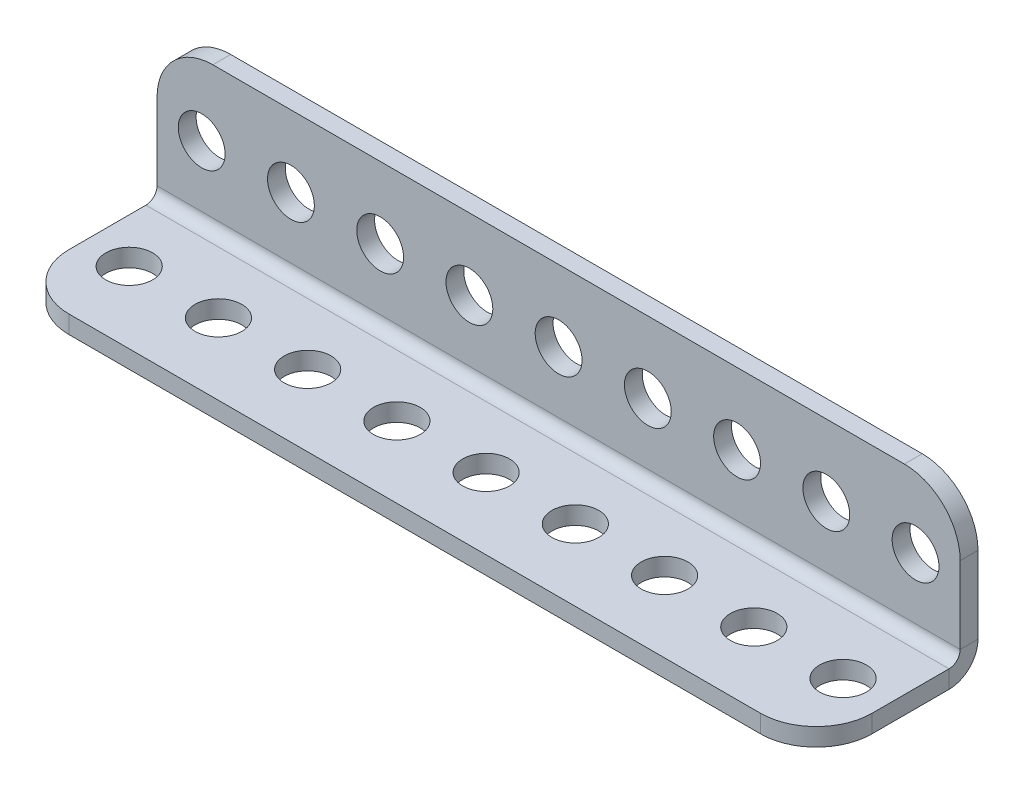
ISO-10303-21;
HEADER;
FILE_DESCRIPTION(('STEP AP214'),'2;1');
FILE_NAME('part.step','',(''),(''),'','','');
FILE_SCHEMA(('AUTOMOTIVE_DESIGN { 1 0 10303 214 1 1 1 1 }'));
ENDSEC;
DATA;
#1=APPLICATION_CONTEXT('core data for automotive mechanical design processes');
#2=APPLICATION_PROTOCOL_DEFINITION('international standard','automotive_design',2000,#1);
#3=PRODUCT_CONTEXT('',#1,'mechanical');
#4=PRODUCT('Part','Part','',(#3));
#5=PRODUCT_RELATED_PRODUCT_CATEGORY('part','',(#4));
#6=PRODUCT_DEFINITION_FORMATION('','',#4);
#7=PRODUCT_DEFINITION_CONTEXT('part definition',#1,'design');
#8=PRODUCT_DEFINITION('design','',#6,#7);
#9=PRODUCT_DEFINITION_SHAPE('','',#8);
#10=(LENGTH_UNIT() NAMED_UNIT(*) SI_UNIT(.MILLI.,.METRE.));
#11=(NAMED_UNIT(*) PLANE_ANGLE_UNIT() SI_UNIT($,.RADIAN.));
#12=(NAMED_UNIT(*) SI_UNIT($,.STERADIAN.) SOLID_ANGLE_UNIT());
#13=UNCERTAINTY_MEASURE_WITH_UNIT(LENGTH_MEASURE(1.E-05),#10,'distance_accuracy_value','');
#14=(GEOMETRIC_REPRESENTATION_CONTEXT(3) GLOBAL_UNCERTAINTY_ASSIGNED_CONTEXT((#13)) GLOBAL_UNIT_ASSIGNED_CONTEXT((#10,
#11,#12)) REPRESENTATION_CONTEXT('',''));
#15=CARTESIAN_POINT('',(0.,0.,0.));
#16=DIRECTION('',(0.,0.,1.));
#17=DIRECTION('',(1.,0.,0.));
#18=AXIS2_PLACEMENT_3D('',#15,#16,#17);
#19=CARTESIAN_POINT('',(72.,0.,2.6));
#20=DIRECTION('',(1.,0.,0.));
#21=DIRECTION('',(0.,0.,-1.));
#22=AXIS2_PLACEMENT_3D('',#19,#20,#21);
#23=PLANE('',#22);
#24=DIRECTION('',(0.,1.,0.));
#25=VECTOR('',#24,1.);
#26=CARTESIAN_POINT('',(72.,0.,2.6));
#27=LINE('',#26,#25);
#28=CARTESIAN_POINT('',(72.,0.,2.6));
#29=VERTEX_POINT('',#28);
#30=CARTESIAN_POINT('',(72.,1.6,2.6));
#31=VERTEX_POINT('',#30);
#32=EDGE_CURVE('E130',#29,#31,#27,.T.);
#33=ORIENTED_EDGE('',*,*,#32,.F.);
#34=CARTESIAN_POINT('',(72.,2.6,2.6));
#35=DIRECTION('',(1.,0.,0.));
#36=DIRECTION('',(0.,0.,-1.));
#37=AXIS2_PLACEMENT_3D('',#34,#35,#36);
#38=CIRCLE('',#37,2.6);
#39=CARTESIAN_POINT('',(72.,2.60000000000001,0.));
#40=VERTEX_POINT('',#39);
#41=EDGE_CURVE('E134',#40,#29,#38,.F.);
#42=ORIENTED_EDGE('',*,*,#41,.F.);
#43=DIRECTION('',(0.,0.,-1.));
#44=VECTOR('',#43,1.);
#45=CARTESIAN_POINT('',(72.,2.6,1.6));
#46=LINE('',#45,#44);
#47=CARTESIAN_POINT('',(72.,2.6,1.6));
#48=VERTEX_POINT('',#47);
#49=EDGE_CURVE('E142',#48,#40,#46,.T.);
#50=ORIENTED_EDGE('',*,*,#49,.F.);
#51=CARTESIAN_POINT('',(72.,2.6,2.6));
#52=DIRECTION('',(1.,0.,0.));
#53=DIRECTION('',(0.,0.,-1.));
#54=AXIS2_PLACEMENT_3D('',#51,#52,#53);
#55=CIRCLE('',#54,1.);
#56=EDGE_CURVE('E136',#48,#31,#55,.F.);
#57=ORIENTED_EDGE('',*,*,#56,.T.);
#58=EDGE_LOOP('',(#33,#42,#50,#57));
#59=FACE_BOUND('',#58,.T.);
#60=ADVANCED_FACE('F39',(#59),#23,.T.);
#61=CARTESIAN_POINT('',(72.,2.6,1.6));
#62=DIRECTION('',(1.,0.,0.));
#63=DIRECTION('',(0.,0.,-1.));
#64=AXIS2_PLACEMENT_3D('',#61,#62,#63);
#65=PLANE('',#64);
#66=DIRECTION('',(0.,0.,1.));
#67=VECTOR('',#66,1.);
#68=CARTESIAN_POINT('',(72.,1.6,0.));
#69=LINE('',#68,#67);
#70=CARTESIAN_POINT('',(72.,1.6,9.5));
#71=VERTEX_POINT('',#70);
#72=EDGE_CURVE('E164',#31,#71,#69,.T.);
#73=ORIENTED_EDGE('',*,*,#72,.T.);
#74=DIRECTION('',(0.,1.,0.));
#75=VECTOR('',#74,1.);
#76=CARTESIAN_POINT('',(72.,2.6,9.5));
#77=LINE('',#76,#75);
#78=CARTESIAN_POINT('',(72.,0.,9.5));
#79=VERTEX_POINT('',#78);
#80=EDGE_CURVE('E163',#71,#79,#77,.F.);
#81=ORIENTED_EDGE('',*,*,#80,.T.);
#82=DIRECTION('',(0.,0.,1.));
#83=VECTOR('',#82,1.);
#84=CARTESIAN_POINT('',(72.,0.,0.));
#85=LINE('',#84,#83);
#86=EDGE_CURVE('E151',#29,#79,#85,.T.);
#87=ORIENTED_EDGE('',*,*,#86,.F.);
#88=ORIENTED_EDGE('',*,*,#32,.T.);
#89=EDGE_LOOP('',(#73,#81,#87,#88));
#90=FACE_BOUND('',#89,.T.);
#91=ADVANCED_FACE('F161',(#90),#65,.T.);
#92=CARTESIAN_POINT('',(0.,2.60000000000001,0.));
#93=DIRECTION('',(-1.,0.,0.));
#94=DIRECTION('',(0.,0.,1.));
#95=AXIS2_PLACEMENT_3D('',#92,#93,#94);
#96=PLANE('',#95);
#97=DIRECTION('',(0.,0.,1.));
#98=VECTOR('',#97,1.);
#99=CARTESIAN_POINT('',(0.,2.60000000000001,0.));
#100=LINE('',#99,#98);
#101=CARTESIAN_POINT('',(0.,2.60000000000001,0.));
#102=VERTEX_POINT('',#101);
#103=CARTESIAN_POINT('',(0.,2.6,1.6));
#104=VERTEX_POINT('',#103);
#105=EDGE_CURVE('E209',#102,#104,#100,.T.);
#106=ORIENTED_EDGE('',*,*,#105,.F.);
#107=CARTESIAN_POINT('',(0.,2.6,2.6));
#108=DIRECTION('',(1.,0.,0.));
#109=DIRECTION('',(0.,0.,-1.));
#110=AXIS2_PLACEMENT_3D('',#107,#108,#109);
#111=CIRCLE('',#110,2.6);
#112=CARTESIAN_POINT('',(0.,0.,2.6));
#113=VERTEX_POINT('',#112);
#114=EDGE_CURVE('E183',#102,#113,#111,.F.);
#115=ORIENTED_EDGE('',*,*,#114,.T.);
#116=DIRECTION('',(0.,-1.,0.));
#117=VECTOR('',#116,1.);
#118=CARTESIAN_POINT('',(0.,1.6,2.6));
#119=LINE('',#118,#117);
#120=CARTESIAN_POINT('',(0.,1.6,2.6));
#121=VERTEX_POINT('',#120);
#122=EDGE_CURVE('E207',#121,#113,#119,.T.);
#123=ORIENTED_EDGE('',*,*,#122,.F.);
#124=CARTESIAN_POINT('',(0.,2.6,2.6));
#125=DIRECTION('',(1.,0.,0.));
#126=DIRECTION('',(0.,0.,-1.));
#127=AXIS2_PLACEMENT_3D('',#124,#125,#126);
#128=CIRCLE('',#127,1.);
#129=EDGE_CURVE('E189',#104,#121,#128,.F.);
#130=ORIENTED_EDGE('',*,*,#129,.F.);
#131=EDGE_LOOP('',(#106,#115,#123,#130));
#132=FACE_BOUND('',#131,.T.);
#133=ADVANCED_FACE('F422',(#132),#96,.T.);
#134=CARTESIAN_POINT('',(0.,1.6,2.6));
#135=DIRECTION('',(-1.,0.,0.));
#136=DIRECTION('',(0.,0.,1.));
#137=AXIS2_PLACEMENT_3D('',#134,#135,#136);
#138=PLANE('',#137);
#139=DIRECTION('',(0.,-1.,0.));
#140=VECTOR('',#139,1.);
#141=CARTESIAN_POINT('',(0.,14.5,1.6));
#142=LINE('',#141,#140);
#143=CARTESIAN_POINT('',(0.,9.5,1.6));
#144=VERTEX_POINT('',#143);
#145=EDGE_CURVE('E187',#144,#104,#142,.T.);
#146=ORIENTED_EDGE('',*,*,#145,.F.);
#147=DIRECTION('',(0.,0.,-1.));
#148=VECTOR('',#147,1.);
#149=CARTESIAN_POINT('',(0.,9.5,2.6));
#150=LINE('',#149,#148);
#151=CARTESIAN_POINT('',(0.,9.5,0.));
#152=VERTEX_POINT('',#151);
#153=EDGE_CURVE('E11',#144,#152,#150,.T.);
#154=ORIENTED_EDGE('',*,*,#153,.T.);
#155=DIRECTION('',(0.,-1.,0.));
#156=VECTOR('',#155,1.);
#157=CARTESIAN_POINT('',(0.,14.5,0.));
#158=LINE('',#157,#156);
#159=EDGE_CURVE('E185',#152,#102,#158,.T.);
#160=ORIENTED_EDGE('',*,*,#159,.T.);
#161=ORIENTED_EDGE('',*,*,#105,.T.);
#162=EDGE_LOOP('',(#146,#154,#160,#161));
#163=FACE_BOUND('',#162,.T.);
#164=ADVANCED_FACE('F383',(#163),#138,.T.);
#165=CARTESIAN_POINT('',(72.,1.6,0.));
#166=DIRECTION('',(0.,-1.,0.));
#167=DIRECTION('',(0.,0.,-1.));
#168=AXIS2_PLACEMENT_3D('',#165,#166,#167);
#169=PLANE('',#168);
#170=CARTESIAN_POINT('',(68.,1.6,8.1));
#171=DIRECTION('',(0.,1.,0.));
#172=DIRECTION('',(0.,0.,1.));
#173=AXIS2_PLACEMENT_3D('',#170,#171,#172);
#174=CIRCLE('',#173,2.1);
#175=CARTESIAN_POINT('',(68.,1.6,10.2));
#176=VERTEX_POINT('',#175);
#177=EDGE_CURVE('E365',#176,#176,#174,.T.);
#178=ORIENTED_EDGE('',*,*,#177,.F.);
#179=EDGE_LOOP('',(#178));
#180=FACE_BOUND('',#179,.T.);
#181=CARTESIAN_POINT('',(60.,1.6,8.1));
#182=DIRECTION('',(0.,1.,0.));
#183=DIRECTION('',(0.,0.,1.));
#184=AXIS2_PLACEMENT_3D('',#181,#182,#183);
#185=CIRCLE('',#184,2.1);
#186=CARTESIAN_POINT('',(60.,1.6,10.2));
#187=VERTEX_POINT('',#186);
#188=EDGE_CURVE('E359',#187,#187,#185,.T.);
#189=ORIENTED_EDGE('',*,*,#188,.F.);
#190=EDGE_LOOP('',(#189));
#191=FACE_BOUND('',#190,.T.);
#192=CARTESIAN_POINT('',(52.,1.6,8.1));
#193=DIRECTION('',(0.,1.,0.));
#194=DIRECTION('',(0.,0.,1.));
#195=AXIS2_PLACEMENT_3D('',#192,#193,#194);
#196=CIRCLE('',#195,2.1);
#197=CARTESIAN_POINT('',(52.,1.6,10.2));
#198=VERTEX_POINT('',#197);
#199=EDGE_CURVE('E353',#198,#198,#196,.T.);
#200=ORIENTED_EDGE('',*,*,#199,.F.);
#201=EDGE_LOOP('',(#200));
#202=FACE_BOUND('',#201,.T.);
#203=CARTESIAN_POINT('',(44.,1.6,8.1));
#204=DIRECTION('',(0.,1.,0.));
#205=DIRECTION('',(0.,0.,1.));
#206=AXIS2_PLACEMENT_3D('',#203,#204,#205);
#207=CIRCLE('',#206,2.1);
#208=CARTESIAN_POINT('',(44.,1.6,10.2));
#209=VERTEX_POINT('',#208);
#210=EDGE_CURVE('E347',#209,#209,#207,.T.);
#211=ORIENTED_EDGE('',*,*,#210,.F.);
#212=EDGE_LOOP('',(#211));
#213=FACE_BOUND('',#212,.T.);
#214=CARTESIAN_POINT('',(36.,1.6,8.1));
#215=DIRECTION('',(0.,1.,0.));
#216=DIRECTION('',(0.,0.,1.));
#217=AXIS2_PLACEMENT_3D('',#214,#215,#216);
#218=CIRCLE('',#217,2.1);
#219=CARTESIAN_POINT('',(36.,1.6,10.2));
#220=VERTEX_POINT('',#219);
#221=EDGE_CURVE('E341',#220,#220,#218,.T.);
#222=ORIENTED_EDGE('',*,*,#221,.F.);
#223=EDGE_LOOP('',(#222));
#224=FACE_BOUND('',#223,.T.);
#225=CARTESIAN_POINT('',(28.,1.6,8.1));
#226=DIRECTION('',(0.,1.,0.));
#227=DIRECTION('',(0.,0.,1.));
#228=AXIS2_PLACEMENT_3D('',#225,#226,#227);
#229=CIRCLE('',#228,2.1);
#230=CARTESIAN_POINT('',(28.,1.6,10.2));
#231=VERTEX_POINT('',#230);
#232=EDGE_CURVE('E335',#231,#231,#229,.T.);
#233=ORIENTED_EDGE('',*,*,#232,.F.);
#234=EDGE_LOOP('',(#233));
#235=FACE_BOUND('',#234,.T.);
#236=CARTESIAN_POINT('',(20.,1.6,8.1));
#237=DIRECTION('',(0.,1.,0.));
#238=DIRECTION('',(0.,0.,1.));
#239=AXIS2_PLACEMENT_3D('',#236,#237,#238);
#240=CIRCLE('',#239,2.1);
#241=CARTESIAN_POINT('',(20.,1.6,10.2));
#242=VERTEX_POINT('',#241);
#243=EDGE_CURVE('E329',#242,#242,#240,.T.);
#244=ORIENTED_EDGE('',*,*,#243,.F.);
#245=EDGE_LOOP('',(#244));
#246=FACE_BOUND('',#245,.T.);
#247=CARTESIAN_POINT('',(12.,1.6,8.1));
#248=DIRECTION('',(0.,1.,0.));
#249=DIRECTION('',(0.,0.,1.));
#250=AXIS2_PLACEMENT_3D('',#247,#248,#249);
#251=CIRCLE('',#250,2.1);
#252=CARTESIAN_POINT('',(12.,1.6,10.2));
#253=VERTEX_POINT('',#252);
#254=EDGE_CURVE('E323',#253,#253,#251,.T.);
#255=ORIENTED_EDGE('',*,*,#254,.F.);
#256=EDGE_LOOP('',(#255));
#257=FACE_BOUND('',#256,.T.);
#258=CARTESIAN_POINT('',(4.,1.6,8.1));
#259=DIRECTION('',(0.,1.,0.));
#260=DIRECTION('',(0.,0.,1.));
#261=AXIS2_PLACEMENT_3D('',#258,#259,#260);
#262=CIRCLE('',#261,2.1);
#263=CARTESIAN_POINT('',(4.,1.6,10.2));
#264=VERTEX_POINT('',#263);
#265=EDGE_CURVE('E269',#264,#264,#262,.T.);
#266=ORIENTED_EDGE('',*,*,#265,.F.);
#267=EDGE_LOOP('',(#266));
#268=FACE_BOUND('',#267,.T.);
#269=DIRECTION('',(0.,0.,1.));
#270=VECTOR('',#269,1.);
#271=CARTESIAN_POINT('',(0.,1.6,0.));
#272=LINE('',#271,#270);
#273=CARTESIAN_POINT('',(0.,1.6,9.5));
#274=VERTEX_POINT('',#273);
#275=EDGE_CURVE('E178',#121,#274,#272,.T.);
#276=ORIENTED_EDGE('',*,*,#275,.T.);
#277=CARTESIAN_POINT('',(5.,1.6,9.5));
#278=DIRECTION('',(0.,-1.,0.));
#279=DIRECTION('',(0.,0.,-1.));
#280=AXIS2_PLACEMENT_3D('',#277,#278,#279);
#281=CIRCLE('',#280,5.);
#282=CARTESIAN_POINT('',(5.,1.6,14.5));
#283=VERTEX_POINT('',#282);
#284=EDGE_CURVE('E218',#274,#283,#281,.F.);
#285=ORIENTED_EDGE('',*,*,#284,.T.);
#286=DIRECTION('',(-1.,0.,0.));
#287=VECTOR('',#286,1.);
#288=CARTESIAN_POINT('',(72.,1.6,14.5));
#289=LINE('',#288,#287);
#290=CARTESIAN_POINT('',(67.,1.6,14.5));
#291=VERTEX_POINT('',#290);
#292=EDGE_CURVE('E204',#291,#283,#289,.T.);
#293=ORIENTED_EDGE('',*,*,#292,.F.);
#294=CARTESIAN_POINT('',(67.,1.6,9.5));
#295=DIRECTION('',(0.,-1.,0.));
#296=DIRECTION('',(0.,0.,-1.));
#297=AXIS2_PLACEMENT_3D('',#294,#295,#296);
#298=CIRCLE('',#297,5.);
#299=EDGE_CURVE('E216',#291,#71,#298,.F.);
#300=ORIENTED_EDGE('',*,*,#299,.T.);
#301=ORIENTED_EDGE('',*,*,#72,.F.);
#302=DIRECTION('',(-1.,0.,0.));
#303=VECTOR('',#302,1.);
#304=CARTESIAN_POINT('',(72.,1.6,2.6));
#305=LINE('',#304,#303);
#306=EDGE_CURVE('E177',#31,#121,#305,.T.);
#307=ORIENTED_EDGE('',*,*,#306,.T.);
#308=EDGE_LOOP('',(#276,#285,#293,#300,#301,#307));
#309=FACE_BOUND('',#308,.T.);
#310=ADVANCED_FACE('F260',(#180,#191,#202,#213,#224,#235,#246,#257,#268,#309),#169,.F.);
#311=CARTESIAN_POINT('',(72.,0.,14.5));
#312=DIRECTION('',(0.,0.,1.));
#313=DIRECTION('',(1.,0.,0.));
#314=AXIS2_PLACEMENT_3D('',#311,#312,#313);
#315=PLANE('',#314);
#316=ORIENTED_EDGE('',*,*,#292,.T.);
#317=DIRECTION('',(0.,1.,0.));
#318=VECTOR('',#317,1.);
#319=CARTESIAN_POINT('',(5.,0.,14.5));
#320=LINE('',#319,#318);
#321=CARTESIAN_POINT('',(5.,0.,14.5));
#322=VERTEX_POINT('',#321);
#323=EDGE_CURVE('E223',#283,#322,#320,.F.);
#324=ORIENTED_EDGE('',*,*,#323,.T.);
#325=DIRECTION('',(-1.,0.,0.));
#326=VECTOR('',#325,1.);
#327=CARTESIAN_POINT('',(72.,0.,14.5));
#328=LINE('',#327,#326);
#329=CARTESIAN_POINT('',(67.,0.,14.5));
#330=VERTEX_POINT('',#329);
#331=EDGE_CURVE('E158',#330,#322,#328,.T.);
#332=ORIENTED_EDGE('',*,*,#331,.F.);
#333=DIRECTION('',(0.,1.,0.));
#334=VECTOR('',#333,1.);
#335=CARTESIAN_POINT('',(67.,0.,14.5));
#336=LINE('',#335,#334);
#337=EDGE_CURVE('E220',#330,#291,#336,.T.);
#338=ORIENTED_EDGE('',*,*,#337,.T.);
#339=EDGE_LOOP('',(#316,#324,#332,#338));
#340=FACE_BOUND('',#339,.T.);
#341=ADVANCED_FACE('F382',(#340),#315,.T.);
#342=CARTESIAN_POINT('',(72.,0.,0.));
#343=DIRECTION('',(0.,-1.,0.));
#344=DIRECTION('',(0.,0.,-1.));
#345=AXIS2_PLACEMENT_3D('',#342,#343,#344);
#346=PLANE('',#345);
#347=CARTESIAN_POINT('',(68.,0.,8.1));
#348=DIRECTION('',(0.,1.,0.));
#349=DIRECTION('',(0.,0.,1.));
#350=AXIS2_PLACEMENT_3D('',#347,#348,#349);
#351=CIRCLE('',#350,2.1);
#352=CARTESIAN_POINT('',(68.,0.,10.2));
#353=VERTEX_POINT('',#352);
#354=EDGE_CURVE('E362',#353,#353,#351,.T.);
#355=ORIENTED_EDGE('',*,*,#354,.T.);
#356=EDGE_LOOP('',(#355));
#357=FACE_BOUND('',#356,.T.);
#358=CARTESIAN_POINT('',(60.,0.,8.1));
#359=DIRECTION('',(0.,1.,0.));
#360=DIRECTION('',(0.,0.,1.));
#361=AXIS2_PLACEMENT_3D('',#358,#359,#360);
#362=CIRCLE('',#361,2.1);
#363=CARTESIAN_POINT('',(60.,0.,10.2));
#364=VERTEX_POINT('',#363);
#365=EDGE_CURVE('E356',#364,#364,#362,.T.);
#366=ORIENTED_EDGE('',*,*,#365,.T.);
#367=EDGE_LOOP('',(#366));
#368=FACE_BOUND('',#367,.T.);
#369=CARTESIAN_POINT('',(52.,0.,8.1));
#370=DIRECTION('',(0.,1.,0.));
#371=DIRECTION('',(0.,0.,1.));
#372=AXIS2_PLACEMENT_3D('',#369,#370,#371);
#373=CIRCLE('',#372,2.1);
#374=CARTESIAN_POINT('',(52.,0.,10.2));
#375=VERTEX_POINT('',#374);
#376=EDGE_CURVE('E350',#375,#375,#373,.T.);
#377=ORIENTED_EDGE('',*,*,#376,.T.);
#378=EDGE_LOOP('',(#377));
#379=FACE_BOUND('',#378,.T.);
#380=CARTESIAN_POINT('',(44.,0.,8.1));
#381=DIRECTION('',(0.,1.,0.));
#382=DIRECTION('',(0.,0.,1.));
#383=AXIS2_PLACEMENT_3D('',#380,#381,#382);
#384=CIRCLE('',#383,2.1);
#385=CARTESIAN_POINT('',(44.,0.,10.2));
#386=VERTEX_POINT('',#385);
#387=EDGE_CURVE('E344',#386,#386,#384,.T.);
#388=ORIENTED_EDGE('',*,*,#387,.T.);
#389=EDGE_LOOP('',(#388));
#390=FACE_BOUND('',#389,.T.);
#391=CARTESIAN_POINT('',(36.,0.,8.1));
#392=DIRECTION('',(0.,1.,0.));
#393=DIRECTION('',(0.,0.,1.));
#394=AXIS2_PLACEMENT_3D('',#391,#392,#393);
#395=CIRCLE('',#394,2.1);
#396=CARTESIAN_POINT('',(36.,0.,10.2));
#397=VERTEX_POINT('',#396);
#398=EDGE_CURVE('E338',#397,#397,#395,.T.);
#399=ORIENTED_EDGE('',*,*,#398,.T.);
#400=EDGE_LOOP('',(#399));
#401=FACE_BOUND('',#400,.T.);
#402=CARTESIAN_POINT('',(28.,0.,8.1));
#403=DIRECTION('',(0.,1.,0.));
#404=DIRECTION('',(0.,0.,1.));
#405=AXIS2_PLACEMENT_3D('',#402,#403,#404);
#406=CIRCLE('',#405,2.1);
#407=CARTESIAN_POINT('',(28.,0.,10.2));
#408=VERTEX_POINT('',#407);
#409=EDGE_CURVE('E332',#408,#408,#406,.T.);
#410=ORIENTED_EDGE('',*,*,#409,.T.);
#411=EDGE_LOOP('',(#410));
#412=FACE_BOUND('',#411,.T.);
#413=CARTESIAN_POINT('',(20.,0.,8.1));
#414=DIRECTION('',(0.,1.,0.));
#415=DIRECTION('',(0.,0.,1.));
#416=AXIS2_PLACEMENT_3D('',#413,#414,#415);
#417=CIRCLE('',#416,2.1);
#418=CARTESIAN_POINT('',(20.,0.,10.2));
#419=VERTEX_POINT('',#418);
#420=EDGE_CURVE('E326',#419,#419,#417,.T.);
#421=ORIENTED_EDGE('',*,*,#420,.T.);
#422=EDGE_LOOP('',(#421));
#423=FACE_BOUND('',#422,.T.);
#424=CARTESIAN_POINT('',(12.,0.,8.1));
#425=DIRECTION('',(0.,1.,0.));
#426=DIRECTION('',(0.,0.,1.));
#427=AXIS2_PLACEMENT_3D('',#424,#425,#426);
#428=CIRCLE('',#427,2.1);
#429=CARTESIAN_POINT('',(12.,0.,10.2));
#430=VERTEX_POINT('',#429);
#431=EDGE_CURVE('E320',#430,#430,#428,.T.);
#432=ORIENTED_EDGE('',*,*,#431,.T.);
#433=EDGE_LOOP('',(#432));
#434=FACE_BOUND('',#433,.T.);
#435=CARTESIAN_POINT('',(4.,0.,8.1));
#436=DIRECTION('',(0.,1.,0.));
#437=DIRECTION('',(0.,0.,1.));
#438=AXIS2_PLACEMENT_3D('',#435,#436,#437);
#439=CIRCLE('',#438,2.1);
#440=CARTESIAN_POINT('',(4.,0.,10.2));
#441=VERTEX_POINT('',#440);
#442=EDGE_CURVE('E266',#441,#441,#439,.T.);
#443=ORIENTED_EDGE('',*,*,#442,.T.);
#444=EDGE_LOOP('',(#443));
#445=FACE_BOUND('',#444,.T.);
#446=ORIENTED_EDGE('',*,*,#331,.T.);
#447=CARTESIAN_POINT('',(5.,0.,9.5));
#448=DIRECTION('',(0.,-1.,0.));
#449=DIRECTION('',(0.,0.,-1.));
#450=AXIS2_PLACEMENT_3D('',#447,#448,#449);
#451=CIRCLE('',#450,5.);
#452=CARTESIAN_POINT('',(0.,0.,9.5));
#453=VERTEX_POINT('',#452);
#454=EDGE_CURVE('E227',#322,#453,#451,.T.);
#455=ORIENTED_EDGE('',*,*,#454,.T.);
#456=DIRECTION('',(0.,0.,1.));
#457=VECTOR('',#456,1.);
#458=CARTESIAN_POINT('',(0.,0.,0.));
#459=LINE('',#458,#457);
#460=EDGE_CURVE('E154',#113,#453,#459,.T.);
#461=ORIENTED_EDGE('',*,*,#460,.F.);
#462=DIRECTION('',(-1.,0.,0.));
#463=VECTOR('',#462,1.);
#464=CARTESIAN_POINT('',(72.,0.,2.6));
#465=LINE('',#464,#463);
#466=EDGE_CURVE('E148',#29,#113,#465,.T.);
#467=ORIENTED_EDGE('',*,*,#466,.F.);
#468=ORIENTED_EDGE('',*,*,#86,.T.);
#469=CARTESIAN_POINT('',(67.,0.,9.5));
#470=DIRECTION('',(0.,-1.,0.));
#471=DIRECTION('',(0.,0.,-1.));
#472=AXIS2_PLACEMENT_3D('',#469,#470,#471);
#473=CIRCLE('',#472,5.);
#474=EDGE_CURVE('E225',#79,#330,#473,.T.);
#475=ORIENTED_EDGE('',*,*,#474,.T.);
#476=EDGE_LOOP('',(#446,#455,#461,#467,#468,#475));
#477=FACE_BOUND('',#476,.T.);
#478=ADVANCED_FACE('F150',(#357,#368,#379,#390,#401,#412,#423,#434,#445,#477),#346,.T.);
#479=CARTESIAN_POINT('',(72.,2.6,2.6));
#480=DIRECTION('',(-1.,0.,0.));
#481=DIRECTION('',(0.,0.,1.));
#482=AXIS2_PLACEMENT_3D('',#479,#480,#481);
#483=CYLINDRICAL_SURFACE('',#482,2.6);
#484=ORIENTED_EDGE('',*,*,#114,.F.);
#485=DIRECTION('',(-1.,0.,0.));
#486=VECTOR('',#485,1.);
#487=CARTESIAN_POINT('',(72.,2.60000000000001,0.));
#488=LINE('',#487,#486);
#489=EDGE_CURVE('E159',#40,#102,#488,.T.);
#490=ORIENTED_EDGE('',*,*,#489,.F.);
#491=ORIENTED_EDGE('',*,*,#41,.T.);
#492=ORIENTED_EDGE('',*,*,#466,.T.);
#493=EDGE_LOOP('',(#484,#490,#491,#492));
#494=FACE_BOUND('',#493,.T.);
#495=ADVANCED_FACE('F167',(#494),#483,.T.);
#496=CARTESIAN_POINT('',(72.,14.5,0.));
#497=DIRECTION('',(0.,0.,-1.));
#498=DIRECTION('',(0.,1.,0.));
#499=AXIS2_PLACEMENT_3D('',#496,#497,#498);
#500=PLANE('',#499);
#501=CARTESIAN_POINT('',(68.,8.1,0.));
#502=DIRECTION('',(0.,0.,1.));
#503=DIRECTION('',(1.,0.,0.));
#504=AXIS2_PLACEMENT_3D('',#501,#502,#503);
#505=CIRCLE('',#504,2.1);
#506=CARTESIAN_POINT('',(70.1,8.1,0.));
#507=VERTEX_POINT('',#506);
#508=EDGE_CURVE('E314',#507,#507,#505,.T.);
#509=ORIENTED_EDGE('',*,*,#508,.T.);
#510=EDGE_LOOP('',(#509));
#511=FACE_BOUND('',#510,.T.);
#512=CARTESIAN_POINT('',(60.,8.1,0.));
#513=DIRECTION('',(0.,0.,1.));
#514=DIRECTION('',(1.,0.,0.));
#515=AXIS2_PLACEMENT_3D('',#512,#513,#514);
#516=CIRCLE('',#515,2.1);
#517=CARTESIAN_POINT('',(62.1,8.1,0.));
#518=VERTEX_POINT('',#517);
#519=EDGE_CURVE('E308',#518,#518,#516,.T.);
#520=ORIENTED_EDGE('',*,*,#519,.T.);
#521=EDGE_LOOP('',(#520));
#522=FACE_BOUND('',#521,.T.);
#523=CARTESIAN_POINT('',(52.,8.1,0.));
#524=DIRECTION('',(0.,0.,1.));
#525=DIRECTION('',(1.,0.,0.));
#526=AXIS2_PLACEMENT_3D('',#523,#524,#525);
#527=CIRCLE('',#526,2.1);
#528=CARTESIAN_POINT('',(54.1,8.1,0.));
#529=VERTEX_POINT('',#528);
#530=EDGE_CURVE('E302',#529,#529,#527,.T.);
#531=ORIENTED_EDGE('',*,*,#530,.T.);
#532=EDGE_LOOP('',(#531));
#533=FACE_BOUND('',#532,.T.);
#534=CARTESIAN_POINT('',(44.,8.1,0.));
#535=DIRECTION('',(0.,0.,1.));
#536=DIRECTION('',(1.,0.,0.));
#537=AXIS2_PLACEMENT_3D('',#534,#535,#536);
#538=CIRCLE('',#537,2.1);
#539=CARTESIAN_POINT('',(46.1,8.1,0.));
#540=VERTEX_POINT('',#539);
#541=EDGE_CURVE('E296',#540,#540,#538,.T.);
#542=ORIENTED_EDGE('',*,*,#541,.T.);
#543=EDGE_LOOP('',(#542));
#544=FACE_BOUND('',#543,.T.);
#545=CARTESIAN_POINT('',(36.,8.1,0.));
#546=DIRECTION('',(0.,0.,1.));
#547=DIRECTION('',(1.,0.,0.));
#548=AXIS2_PLACEMENT_3D('',#545,#546,#547);
#549=CIRCLE('',#548,2.1);
#550=CARTESIAN_POINT('',(38.1,8.1,0.));
#551=VERTEX_POINT('',#550);
#552=EDGE_CURVE('E290',#551,#551,#549,.T.);
#553=ORIENTED_EDGE('',*,*,#552,.T.);
#554=EDGE_LOOP('',(#553));
#555=FACE_BOUND('',#554,.T.);
#556=CARTESIAN_POINT('',(28.,8.1,0.));
#557=DIRECTION('',(0.,0.,1.));
#558=DIRECTION('',(1.,0.,0.));
#559=AXIS2_PLACEMENT_3D('',#556,#557,#558);
#560=CIRCLE('',#559,2.1);
#561=CARTESIAN_POINT('',(30.1,8.1,0.));
#562=VERTEX_POINT('',#561);
#563=EDGE_CURVE('E284',#562,#562,#560,.T.);
#564=ORIENTED_EDGE('',*,*,#563,.T.);
#565=EDGE_LOOP('',(#564));
#566=FACE_BOUND('',#565,.T.);
#567=CARTESIAN_POINT('',(20.,8.1,0.));
#568=DIRECTION('',(0.,0.,1.));
#569=DIRECTION('',(1.,0.,0.));
#570=AXIS2_PLACEMENT_3D('',#567,#568,#569);
#571=CIRCLE('',#570,2.1);
#572=CARTESIAN_POINT('',(22.1,8.1,0.));
#573=VERTEX_POINT('',#572);
#574=EDGE_CURVE('E278',#573,#573,#571,.T.);
#575=ORIENTED_EDGE('',*,*,#574,.T.);
#576=EDGE_LOOP('',(#575));
#577=FACE_BOUND('',#576,.T.);
#578=CARTESIAN_POINT('',(12.,8.1,0.));
#579=DIRECTION('',(0.,0.,1.));
#580=DIRECTION('',(1.,0.,0.));
#581=AXIS2_PLACEMENT_3D('',#578,#579,#580);
#582=CIRCLE('',#581,2.1);
#583=CARTESIAN_POINT('',(14.1,8.1,0.));
#584=VERTEX_POINT('',#583);
#585=EDGE_CURVE('E272',#584,#584,#582,.T.);
#586=ORIENTED_EDGE('',*,*,#585,.T.);
#587=EDGE_LOOP('',(#586));
#588=FACE_BOUND('',#587,.T.);
#589=CARTESIAN_POINT('',(4.,8.1,0.));
#590=DIRECTION('',(0.,0.,1.));
#591=DIRECTION('',(1.,0.,0.));
#592=AXIS2_PLACEMENT_3D('',#589,#590,#591);
#593=CIRCLE('',#592,2.1);
#594=CARTESIAN_POINT('',(6.1,8.1,0.));
#595=VERTEX_POINT('',#594);
#596=EDGE_CURVE('E181',#595,#595,#593,.T.);
#597=ORIENTED_EDGE('',*,*,#596,.T.);
#598=EDGE_LOOP('',(#597));
#599=FACE_BOUND('',#598,.T.);
#600=DIRECTION('',(-1.,0.,0.));
#601=VECTOR('',#600,1.);
#602=CARTESIAN_POINT('',(72.,14.5,0.));
#603=LINE('',#602,#601);
#604=CARTESIAN_POINT('',(67.,14.5,0.));
#605=VERTEX_POINT('',#604);
#606=CARTESIAN_POINT('',(5.,14.5,0.));
#607=VERTEX_POINT('',#606);
#608=EDGE_CURVE('E199',#605,#607,#603,.T.);
#609=ORIENTED_EDGE('',*,*,#608,.F.);
#610=CARTESIAN_POINT('',(67.,9.5,0.));
#611=DIRECTION('',(0.,0.,-1.));
#612=DIRECTION('',(0.,1.,0.));
#613=AXIS2_PLACEMENT_3D('',#610,#611,#612);
#614=CIRCLE('',#613,5.);
#615=CARTESIAN_POINT('',(72.,9.5,0.));
#616=VERTEX_POINT('',#615);
#617=EDGE_CURVE('E237',#605,#616,#614,.T.);
#618=ORIENTED_EDGE('',*,*,#617,.T.);
#619=DIRECTION('',(0.,-1.,0.));
#620=VECTOR('',#619,1.);
#621=CARTESIAN_POINT('',(72.,14.5,0.));
#622=LINE('',#621,#620);
#623=EDGE_CURVE('E169',#616,#40,#622,.T.);
#624=ORIENTED_EDGE('',*,*,#623,.T.);
#625=ORIENTED_EDGE('',*,*,#489,.T.);
#626=ORIENTED_EDGE('',*,*,#159,.F.);
#627=CARTESIAN_POINT('',(5.,9.5,0.));
#628=DIRECTION('',(0.,0.,-1.));
#629=DIRECTION('',(0.,1.,0.));
#630=AXIS2_PLACEMENT_3D('',#627,#628,#629);
#631=CIRCLE('',#630,5.);
#632=EDGE_CURVE('E235',#152,#607,#631,.T.);
#633=ORIENTED_EDGE('',*,*,#632,.T.);
#634=EDGE_LOOP('',(#609,#618,#624,#625,#626,#633));
#635=FACE_BOUND('',#634,.T.);
#636=ADVANCED_FACE('F252',(#511,#522,#533,#544,#555,#566,#577,#588,#599,#635),#500,.T.);
#637=CARTESIAN_POINT('',(72.,14.5,1.6));
#638=DIRECTION('',(0.,1.,0.));
#639=DIRECTION('',(0.,0.,1.));
#640=AXIS2_PLACEMENT_3D('',#637,#638,#639);
#641=PLANE('',#640);
#642=DIRECTION('',(-1.,0.,0.));
#643=VECTOR('',#642,1.);
#644=CARTESIAN_POINT('',(72.,14.5,1.6));
#645=LINE('',#644,#643);
#646=CARTESIAN_POINT('',(67.,14.5,1.6));
#647=VERTEX_POINT('',#646);
#648=CARTESIAN_POINT('',(5.,14.5,1.6));
#649=VERTEX_POINT('',#648);
#650=EDGE_CURVE('E197',#647,#649,#645,.T.);
#651=ORIENTED_EDGE('',*,*,#650,.F.);
#652=DIRECTION('',(0.,0.,-1.));
#653=VECTOR('',#652,1.);
#654=CARTESIAN_POINT('',(67.,14.5,1.6));
#655=LINE('',#654,#653);
#656=EDGE_CURVE('E232',#647,#605,#655,.T.);
#657=ORIENTED_EDGE('',*,*,#656,.T.);
#658=ORIENTED_EDGE('',*,*,#608,.T.);
#659=DIRECTION('',(0.,0.,-1.));
#660=VECTOR('',#659,1.);
#661=CARTESIAN_POINT('',(5.,14.5,1.6));
#662=LINE('',#661,#660);
#663=EDGE_CURVE('E230',#607,#649,#662,.F.);
#664=ORIENTED_EDGE('',*,*,#663,.T.);
#665=EDGE_LOOP('',(#651,#657,#658,#664));
#666=FACE_BOUND('',#665,.T.);
#667=ADVANCED_FACE('F247',(#666),#641,.T.);
#668=CARTESIAN_POINT('',(72.,14.5,1.6));
#669=DIRECTION('',(0.,0.,-1.));
#670=DIRECTION('',(0.,1.,0.));
#671=AXIS2_PLACEMENT_3D('',#668,#669,#670);
#672=PLANE('',#671);
#673=CARTESIAN_POINT('',(68.,8.1,1.6));
#674=DIRECTION('',(0.,0.,1.));
#675=DIRECTION('',(1.,0.,0.));
#676=AXIS2_PLACEMENT_3D('',#673,#674,#675);
#677=CIRCLE('',#676,2.1);
#678=CARTESIAN_POINT('',(70.1,8.1,1.6));
#679=VERTEX_POINT('',#678);
#680=EDGE_CURVE('E317',#679,#679,#677,.T.);
#681=ORIENTED_EDGE('',*,*,#680,.F.);
#682=EDGE_LOOP('',(#681));
#683=FACE_BOUND('',#682,.T.);
#684=CARTESIAN_POINT('',(60.,8.1,1.6));
#685=DIRECTION('',(0.,0.,1.));
#686=DIRECTION('',(1.,0.,0.));
#687=AXIS2_PLACEMENT_3D('',#684,#685,#686);
#688=CIRCLE('',#687,2.1);
#689=CARTESIAN_POINT('',(62.1,8.1,1.6));
#690=VERTEX_POINT('',#689);
#691=EDGE_CURVE('E311',#690,#690,#688,.T.);
#692=ORIENTED_EDGE('',*,*,#691,.F.);
#693=EDGE_LOOP('',(#692));
#694=FACE_BOUND('',#693,.T.);
#695=CARTESIAN_POINT('',(52.,8.1,1.6));
#696=DIRECTION('',(0.,0.,1.));
#697=DIRECTION('',(1.,0.,0.));
#698=AXIS2_PLACEMENT_3D('',#695,#696,#697);
#699=CIRCLE('',#698,2.1);
#700=CARTESIAN_POINT('',(54.1,8.1,1.6));
#701=VERTEX_POINT('',#700);
#702=EDGE_CURVE('E305',#701,#701,#699,.T.);
#703=ORIENTED_EDGE('',*,*,#702,.F.);
#704=EDGE_LOOP('',(#703));
#705=FACE_BOUND('',#704,.T.);
#706=CARTESIAN_POINT('',(44.,8.1,1.6));
#707=DIRECTION('',(0.,0.,1.));
#708=DIRECTION('',(1.,0.,0.));
#709=AXIS2_PLACEMENT_3D('',#706,#707,#708);
#710=CIRCLE('',#709,2.1);
#711=CARTESIAN_POINT('',(46.1,8.1,1.6));
#712=VERTEX_POINT('',#711);
#713=EDGE_CURVE('E299',#712,#712,#710,.T.);
#714=ORIENTED_EDGE('',*,*,#713,.F.);
#715=EDGE_LOOP('',(#714));
#716=FACE_BOUND('',#715,.T.);
#717=CARTESIAN_POINT('',(36.,8.1,1.6));
#718=DIRECTION('',(0.,0.,1.));
#719=DIRECTION('',(1.,0.,0.));
#720=AXIS2_PLACEMENT_3D('',#717,#718,#719);
#721=CIRCLE('',#720,2.1);
#722=CARTESIAN_POINT('',(38.1,8.1,1.6));
#723=VERTEX_POINT('',#722);
#724=EDGE_CURVE('E293',#723,#723,#721,.T.);
#725=ORIENTED_EDGE('',*,*,#724,.F.);
#726=EDGE_LOOP('',(#725));
#727=FACE_BOUND('',#726,.T.);
#728=CARTESIAN_POINT('',(28.,8.1,1.6));
#729=DIRECTION('',(0.,0.,1.));
#730=DIRECTION('',(1.,0.,0.));
#731=AXIS2_PLACEMENT_3D('',#728,#729,#730);
#732=CIRCLE('',#731,2.1);
#733=CARTESIAN_POINT('',(30.1,8.1,1.6));
#734=VERTEX_POINT('',#733);
#735=EDGE_CURVE('E287',#734,#734,#732,.T.);
#736=ORIENTED_EDGE('',*,*,#735,.F.);
#737=EDGE_LOOP('',(#736));
#738=FACE_BOUND('',#737,.T.);
#739=CARTESIAN_POINT('',(20.,8.1,1.6));
#740=DIRECTION('',(0.,0.,1.));
#741=DIRECTION('',(1.,0.,0.));
#742=AXIS2_PLACEMENT_3D('',#739,#740,#741);
#743=CIRCLE('',#742,2.1);
#744=CARTESIAN_POINT('',(22.1,8.1,1.6));
#745=VERTEX_POINT('',#744);
#746=EDGE_CURVE('E281',#745,#745,#743,.T.);
#747=ORIENTED_EDGE('',*,*,#746,.F.);
#748=EDGE_LOOP('',(#747));
#749=FACE_BOUND('',#748,.T.);
#750=CARTESIAN_POINT('',(12.,8.1,1.6));
#751=DIRECTION('',(0.,0.,1.));
#752=DIRECTION('',(1.,0.,0.));
#753=AXIS2_PLACEMENT_3D('',#750,#751,#752);
#754=CIRCLE('',#753,2.1);
#755=CARTESIAN_POINT('',(14.1,8.1,1.6));
#756=VERTEX_POINT('',#755);
#757=EDGE_CURVE('E275',#756,#756,#754,.T.);
#758=ORIENTED_EDGE('',*,*,#757,.F.);
#759=EDGE_LOOP('',(#758));
#760=FACE_BOUND('',#759,.T.);
#761=CARTESIAN_POINT('',(4.,8.1,1.6));
#762=DIRECTION('',(0.,0.,1.));
#763=DIRECTION('',(1.,0.,0.));
#764=AXIS2_PLACEMENT_3D('',#761,#762,#763);
#765=CIRCLE('',#764,2.1);
#766=CARTESIAN_POINT('',(6.1,8.1,1.6));
#767=VERTEX_POINT('',#766);
#768=EDGE_CURVE('E263',#767,#767,#765,.T.);
#769=ORIENTED_EDGE('',*,*,#768,.F.);
#770=EDGE_LOOP('',(#769));
#771=FACE_BOUND('',#770,.T.);
#772=DIRECTION('',(0.,-1.,0.));
#773=VECTOR('',#772,1.);
#774=CARTESIAN_POINT('',(72.,14.5,1.6));
#775=LINE('',#774,#773);
#776=CARTESIAN_POINT('',(72.,9.5,1.6));
#777=VERTEX_POINT('',#776);
#778=EDGE_CURVE('E171',#777,#48,#775,.T.);
#779=ORIENTED_EDGE('',*,*,#778,.F.);
#780=CARTESIAN_POINT('',(67.,9.5,1.6));
#781=DIRECTION('',(0.,0.,-1.));
#782=DIRECTION('',(0.,1.,0.));
#783=AXIS2_PLACEMENT_3D('',#780,#781,#782);
#784=CIRCLE('',#783,5.);
#785=EDGE_CURVE('E47',#777,#647,#784,.F.);
#786=ORIENTED_EDGE('',*,*,#785,.T.);
#787=ORIENTED_EDGE('',*,*,#650,.T.);
#788=CARTESIAN_POINT('',(5.,9.5,1.6));
#789=DIRECTION('',(0.,0.,-1.));
#790=DIRECTION('',(0.,1.,0.));
#791=AXIS2_PLACEMENT_3D('',#788,#789,#790);
#792=CIRCLE('',#791,5.);
#793=EDGE_CURVE('E54',#649,#144,#792,.F.);
#794=ORIENTED_EDGE('',*,*,#793,.T.);
#795=ORIENTED_EDGE('',*,*,#145,.T.);
#796=DIRECTION('',(-1.,0.,0.));
#797=VECTOR('',#796,1.);
#798=CARTESIAN_POINT('',(72.,2.6,1.6));
#799=LINE('',#798,#797);
#800=EDGE_CURVE('E194',#48,#104,#799,.T.);
#801=ORIENTED_EDGE('',*,*,#800,.F.);
#802=EDGE_LOOP('',(#779,#786,#787,#794,#795,#801));
#803=FACE_BOUND('',#802,.T.);
#804=ADVANCED_FACE('F242',(#683,#694,#705,#716,#727,#738,#749,#760,#771,#803),#672,.F.);
#805=CARTESIAN_POINT('',(72.,2.6,2.6));
#806=DIRECTION('',(-1.,0.,0.));
#807=DIRECTION('',(0.,0.,1.));
#808=AXIS2_PLACEMENT_3D('',#805,#806,#807);
#809=CYLINDRICAL_SURFACE('',#808,1.);
#810=ORIENTED_EDGE('',*,*,#129,.T.);
#811=ORIENTED_EDGE('',*,*,#306,.F.);
#812=ORIENTED_EDGE('',*,*,#56,.F.);
#813=ORIENTED_EDGE('',*,*,#800,.T.);
#814=EDGE_LOOP('',(#810,#811,#812,#813));
#815=FACE_BOUND('',#814,.T.);
#816=ADVANCED_FACE('F256',(#815),#809,.F.);
#817=CARTESIAN_POINT('',(72.,2.6,2.6));
#818=DIRECTION('',(1.,0.,0.));
#819=DIRECTION('',(0.,0.,-1.));
#820=AXIS2_PLACEMENT_3D('',#817,#818,#819);
#821=PLANE('',#820);
#822=ORIENTED_EDGE('',*,*,#623,.F.);
#823=DIRECTION('',(0.,0.,-1.));
#824=VECTOR('',#823,1.);
#825=CARTESIAN_POINT('',(72.,9.5,2.6));
#826=LINE('',#825,#824);
#827=EDGE_CURVE('E62',#616,#777,#826,.F.);
#828=ORIENTED_EDGE('',*,*,#827,.T.);
#829=ORIENTED_EDGE('',*,*,#778,.T.);
#830=ORIENTED_EDGE('',*,*,#49,.T.);
#831=EDGE_LOOP('',(#822,#828,#829,#830));
#832=FACE_BOUND('',#831,.T.);
#833=ADVANCED_FACE('F253',(#832),#821,.T.);
#834=CARTESIAN_POINT('',(0.,2.6,2.6));
#835=DIRECTION('',(1.,0.,0.));
#836=DIRECTION('',(0.,0.,-1.));
#837=AXIS2_PLACEMENT_3D('',#834,#835,#836);
#838=PLANE('',#837);
#839=ORIENTED_EDGE('',*,*,#460,.T.);
#840=DIRECTION('',(0.,1.,0.));
#841=VECTOR('',#840,1.);
#842=CARTESIAN_POINT('',(0.,1.6,9.5));
#843=LINE('',#842,#841);
#844=EDGE_CURVE('E141',#453,#274,#843,.T.);
#845=ORIENTED_EDGE('',*,*,#844,.T.);
#846=ORIENTED_EDGE('',*,*,#275,.F.);
#847=ORIENTED_EDGE('',*,*,#122,.T.);
#848=EDGE_LOOP('',(#839,#845,#846,#847));
#849=FACE_BOUND('',#848,.T.);
#850=ADVANCED_FACE('F430',(#849),#838,.F.);
#851=CARTESIAN_POINT('',(5.,2.6,9.5));
#852=DIRECTION('',(0.,-1.,0.));
#853=DIRECTION('',(0.,0.,-1.));
#854=AXIS2_PLACEMENT_3D('',#851,#852,#853);
#855=CYLINDRICAL_SURFACE('',#854,5.);
#856=ORIENTED_EDGE('',*,*,#454,.F.);
#857=ORIENTED_EDGE('',*,*,#323,.F.);
#858=ORIENTED_EDGE('',*,*,#284,.F.);
#859=ORIENTED_EDGE('',*,*,#844,.F.);
#860=EDGE_LOOP('',(#856,#857,#858,#859));
#861=FACE_BOUND('',#860,.T.);
#862=ADVANCED_FACE('F426',(#861),#855,.T.);
#863=CARTESIAN_POINT('',(67.,0.,9.5));
#864=DIRECTION('',(0.,1.,0.));
#865=DIRECTION('',(0.,0.,1.));
#866=AXIS2_PLACEMENT_3D('',#863,#864,#865);
#867=CYLINDRICAL_SURFACE('',#866,5.);
#868=ORIENTED_EDGE('',*,*,#474,.F.);
#869=ORIENTED_EDGE('',*,*,#80,.F.);
#870=ORIENTED_EDGE('',*,*,#299,.F.);
#871=ORIENTED_EDGE('',*,*,#337,.F.);
#872=EDGE_LOOP('',(#868,#869,#870,#871));
#873=FACE_BOUND('',#872,.T.);
#874=ADVANCED_FACE('F429',(#873),#867,.T.);
#875=CARTESIAN_POINT('',(67.,9.5,1.6));
#876=DIRECTION('',(0.,0.,-1.));
#877=DIRECTION('',(-1.,0.,0.));
#878=AXIS2_PLACEMENT_3D('',#875,#876,#877);
#879=CYLINDRICAL_SURFACE('',#878,5.);
#880=ORIENTED_EDGE('',*,*,#785,.F.);
#881=ORIENTED_EDGE('',*,*,#827,.F.);
#882=ORIENTED_EDGE('',*,*,#617,.F.);
#883=ORIENTED_EDGE('',*,*,#656,.F.);
#884=EDGE_LOOP('',(#880,#881,#882,#883));
#885=FACE_BOUND('',#884,.T.);
#886=ADVANCED_FACE('F250',(#885),#879,.T.);
#887=CARTESIAN_POINT('',(5.,9.5,2.6));
#888=DIRECTION('',(0.,0.,-1.));
#889=DIRECTION('',(-1.,0.,0.));
#890=AXIS2_PLACEMENT_3D('',#887,#888,#889);
#891=CYLINDRICAL_SURFACE('',#890,5.);
#892=ORIENTED_EDGE('',*,*,#793,.F.);
#893=ORIENTED_EDGE('',*,*,#663,.F.);
#894=ORIENTED_EDGE('',*,*,#632,.F.);
#895=ORIENTED_EDGE('',*,*,#153,.F.);
#896=EDGE_LOOP('',(#892,#893,#894,#895));
#897=FACE_BOUND('',#896,.T.);
#898=ADVANCED_FACE('F41',(#897),#891,.T.);
#899=CARTESIAN_POINT('',(4.,8.1,0.));
#900=DIRECTION('',(0.,0.,1.));
#901=DIRECTION('',(1.,0.,0.));
#902=AXIS2_PLACEMENT_3D('',#899,#900,#901);
#903=CYLINDRICAL_SURFACE('',#902,2.1);
#904=ORIENTED_EDGE('',*,*,#596,.F.);
#905=EDGE_LOOP('',(#904));
#906=FACE_BOUND('',#905,.T.);
#907=ORIENTED_EDGE('',*,*,#768,.T.);
#908=EDGE_LOOP('',(#907));
#909=FACE_BOUND('',#908,.T.);
#910=ADVANCED_FACE('F404',(#906,#909),#903,.F.);
#911=CARTESIAN_POINT('',(4.,0.,8.1));
#912=DIRECTION('',(0.,1.,0.));
#913=DIRECTION('',(0.,0.,1.));
#914=AXIS2_PLACEMENT_3D('',#911,#912,#913);
#915=CYLINDRICAL_SURFACE('',#914,2.1);
#916=ORIENTED_EDGE('',*,*,#442,.F.);
#917=EDGE_LOOP('',(#916));
#918=FACE_BOUND('',#917,.T.);
#919=ORIENTED_EDGE('',*,*,#265,.T.);
#920=EDGE_LOOP('',(#919));
#921=FACE_BOUND('',#920,.T.);
#922=ADVANCED_FACE('F401',(#918,#921),#915,.F.);
#923=CARTESIAN_POINT('',(12.,8.1,0.));
#924=DIRECTION('',(0.,0.,1.));
#925=DIRECTION('',(1.,0.,0.));
#926=AXIS2_PLACEMENT_3D('',#923,#924,#925);
#927=CYLINDRICAL_SURFACE('',#926,2.1);
#928=ORIENTED_EDGE('',*,*,#585,.F.);
#929=EDGE_LOOP('',(#928));
#930=FACE_BOUND('',#929,.T.);
#931=ORIENTED_EDGE('',*,*,#757,.T.);
#932=EDGE_LOOP('',(#931));
#933=FACE_BOUND('',#932,.T.);
#934=ADVANCED_FACE('F403',(#930,#933),#927,.F.);
#935=CARTESIAN_POINT('',(20.,8.1,0.));
#936=DIRECTION('',(0.,0.,1.));
#937=DIRECTION('',(1.,0.,0.));
#938=AXIS2_PLACEMENT_3D('',#935,#936,#937);
#939=CYLINDRICAL_SURFACE('',#938,2.1);
#940=ORIENTED_EDGE('',*,*,#574,.F.);
#941=EDGE_LOOP('',(#940));
#942=FACE_BOUND('',#941,.T.);
#943=ORIENTED_EDGE('',*,*,#746,.T.);
#944=EDGE_LOOP('',(#943));
#945=FACE_BOUND('',#944,.T.);
#946=ADVANCED_FACE('F411',(#942,#945),#939,.F.);
#947=CARTESIAN_POINT('',(28.,8.1,0.));
#948=DIRECTION('',(0.,0.,1.));
#949=DIRECTION('',(1.,0.,0.));
#950=AXIS2_PLACEMENT_3D('',#947,#948,#949);
#951=CYLINDRICAL_SURFACE('',#950,2.1);
#952=ORIENTED_EDGE('',*,*,#563,.F.);
#953=EDGE_LOOP('',(#952));
#954=FACE_BOUND('',#953,.T.);
#955=ORIENTED_EDGE('',*,*,#735,.T.);
#956=EDGE_LOOP('',(#955));
#957=FACE_BOUND('',#956,.T.);
#958=ADVANCED_FACE('F530',(#954,#957),#951,.F.);
#959=CARTESIAN_POINT('',(36.,8.1,0.));
#960=DIRECTION('',(0.,0.,1.));
#961=DIRECTION('',(1.,0.,0.));
#962=AXIS2_PLACEMENT_3D('',#959,#960,#961);
#963=CYLINDRICAL_SURFACE('',#962,2.1);
#964=ORIENTED_EDGE('',*,*,#552,.F.);
#965=EDGE_LOOP('',(#964));
#966=FACE_BOUND('',#965,.T.);
#967=ORIENTED_EDGE('',*,*,#724,.T.);
#968=EDGE_LOOP('',(#967));
#969=FACE_BOUND('',#968,.T.);
#970=ADVANCED_FACE('F541',(#966,#969),#963,.F.);
#971=CARTESIAN_POINT('',(44.,8.1,0.));
#972=DIRECTION('',(0.,0.,1.));
#973=DIRECTION('',(1.,0.,0.));
#974=AXIS2_PLACEMENT_3D('',#971,#972,#973);
#975=CYLINDRICAL_SURFACE('',#974,2.1);
#976=ORIENTED_EDGE('',*,*,#541,.F.);
#977=EDGE_LOOP('',(#976));
#978=FACE_BOUND('',#977,.T.);
#979=ORIENTED_EDGE('',*,*,#713,.T.);
#980=EDGE_LOOP('',(#979));
#981=FACE_BOUND('',#980,.T.);
#982=ADVANCED_FACE('F552',(#978,#981),#975,.F.);
#983=CARTESIAN_POINT('',(52.,8.1,0.));
#984=DIRECTION('',(0.,0.,1.));
#985=DIRECTION('',(1.,0.,0.));
#986=AXIS2_PLACEMENT_3D('',#983,#984,#985);
#987=CYLINDRICAL_SURFACE('',#986,2.1);
#988=ORIENTED_EDGE('',*,*,#530,.F.);
#989=EDGE_LOOP('',(#988));
#990=FACE_BOUND('',#989,.T.);
#991=ORIENTED_EDGE('',*,*,#702,.T.);
#992=EDGE_LOOP('',(#991));
#993=FACE_BOUND('',#992,.T.);
#994=ADVANCED_FACE('F563',(#990,#993),#987,.F.);
#995=CARTESIAN_POINT('',(60.,8.1,0.));
#996=DIRECTION('',(0.,0.,1.));
#997=DIRECTION('',(1.,0.,0.));
#998=AXIS2_PLACEMENT_3D('',#995,#996,#997);
#999=CYLINDRICAL_SURFACE('',#998,2.1);
#1000=ORIENTED_EDGE('',*,*,#519,.F.);
#1001=EDGE_LOOP('',(#1000));
#1002=FACE_BOUND('',#1001,.T.);
#1003=ORIENTED_EDGE('',*,*,#691,.T.);
#1004=EDGE_LOOP('',(#1003));
#1005=FACE_BOUND('',#1004,.T.);
#1006=ADVANCED_FACE('F574',(#1002,#1005),#999,.F.);
#1007=CARTESIAN_POINT('',(68.,8.1,0.));
#1008=DIRECTION('',(0.,0.,1.));
#1009=DIRECTION('',(1.,0.,0.));
#1010=AXIS2_PLACEMENT_3D('',#1007,#1008,#1009);
#1011=CYLINDRICAL_SURFACE('',#1010,2.1);
#1012=ORIENTED_EDGE('',*,*,#508,.F.);
#1013=EDGE_LOOP('',(#1012));
#1014=FACE_BOUND('',#1013,.T.);
#1015=ORIENTED_EDGE('',*,*,#680,.T.);
#1016=EDGE_LOOP('',(#1015));
#1017=FACE_BOUND('',#1016,.T.);
#1018=ADVANCED_FACE('F585',(#1014,#1017),#1011,.F.);
#1019=CARTESIAN_POINT('',(12.,0.,8.1));
#1020=DIRECTION('',(0.,1.,0.));
#1021=DIRECTION('',(0.,0.,1.));
#1022=AXIS2_PLACEMENT_3D('',#1019,#1020,#1021);
#1023=CYLINDRICAL_SURFACE('',#1022,2.1);
#1024=ORIENTED_EDGE('',*,*,#431,.F.);
#1025=EDGE_LOOP('',(#1024));
#1026=FACE_BOUND('',#1025,.T.);
#1027=ORIENTED_EDGE('',*,*,#254,.T.);
#1028=EDGE_LOOP('',(#1027));
#1029=FACE_BOUND('',#1028,.T.);
#1030=ADVANCED_FACE('F596',(#1026,#1029),#1023,.F.);
#1031=CARTESIAN_POINT('',(20.,0.,8.1));
#1032=DIRECTION('',(0.,1.,0.));
#1033=DIRECTION('',(0.,0.,1.));
#1034=AXIS2_PLACEMENT_3D('',#1031,#1032,#1033);
#1035=CYLINDRICAL_SURFACE('',#1034,2.1);
#1036=ORIENTED_EDGE('',*,*,#420,.F.);
#1037=EDGE_LOOP('',(#1036));
#1038=FACE_BOUND('',#1037,.T.);
#1039=ORIENTED_EDGE('',*,*,#243,.T.);
#1040=EDGE_LOOP('',(#1039));
#1041=FACE_BOUND('',#1040,.T.);
#1042=ADVANCED_FACE('F607',(#1038,#1041),#1035,.F.);
#1043=CARTESIAN_POINT('',(28.,0.,8.1));
#1044=DIRECTION('',(0.,1.,0.));
#1045=DIRECTION('',(0.,0.,1.));
#1046=AXIS2_PLACEMENT_3D('',#1043,#1044,#1045);
#1047=CYLINDRICAL_SURFACE('',#1046,2.1);
#1048=ORIENTED_EDGE('',*,*,#409,.F.);
#1049=EDGE_LOOP('',(#1048));
#1050=FACE_BOUND('',#1049,.T.);
#1051=ORIENTED_EDGE('',*,*,#232,.T.);
#1052=EDGE_LOOP('',(#1051));
#1053=FACE_BOUND('',#1052,.T.);
#1054=ADVANCED_FACE('F618',(#1050,#1053),#1047,.F.);
#1055=CARTESIAN_POINT('',(36.,0.,8.1));
#1056=DIRECTION('',(0.,1.,0.));
#1057=DIRECTION('',(0.,0.,1.));
#1058=AXIS2_PLACEMENT_3D('',#1055,#1056,#1057);
#1059=CYLINDRICAL_SURFACE('',#1058,2.1);
#1060=ORIENTED_EDGE('',*,*,#398,.F.);
#1061=EDGE_LOOP('',(#1060));
#1062=FACE_BOUND('',#1061,.T.);
#1063=ORIENTED_EDGE('',*,*,#221,.T.);
#1064=EDGE_LOOP('',(#1063));
#1065=FACE_BOUND('',#1064,.T.);
#1066=ADVANCED_FACE('F629',(#1062,#1065),#1059,.F.);
#1067=CARTESIAN_POINT('',(44.,0.,8.1));
#1068=DIRECTION('',(0.,1.,0.));
#1069=DIRECTION('',(0.,0.,1.));
#1070=AXIS2_PLACEMENT_3D('',#1067,#1068,#1069);
#1071=CYLINDRICAL_SURFACE('',#1070,2.1);
#1072=ORIENTED_EDGE('',*,*,#387,.F.);
#1073=EDGE_LOOP('',(#1072));
#1074=FACE_BOUND('',#1073,.T.);
#1075=ORIENTED_EDGE('',*,*,#210,.T.);
#1076=EDGE_LOOP('',(#1075));
#1077=FACE_BOUND('',#1076,.T.);
#1078=ADVANCED_FACE('F640',(#1074,#1077),#1071,.F.);
#1079=CARTESIAN_POINT('',(52.,0.,8.1));
#1080=DIRECTION('',(0.,1.,0.));
#1081=DIRECTION('',(0.,0.,1.));
#1082=AXIS2_PLACEMENT_3D('',#1079,#1080,#1081);
#1083=CYLINDRICAL_SURFACE('',#1082,2.1);
#1084=ORIENTED_EDGE('',*,*,#376,.F.);
#1085=EDGE_LOOP('',(#1084));
#1086=FACE_BOUND('',#1085,.T.);
#1087=ORIENTED_EDGE('',*,*,#199,.T.);
#1088=EDGE_LOOP('',(#1087));
#1089=FACE_BOUND('',#1088,.T.);
#1090=ADVANCED_FACE('F651',(#1086,#1089),#1083,.F.);
#1091=CARTESIAN_POINT('',(60.,0.,8.1));
#1092=DIRECTION('',(0.,1.,0.));
#1093=DIRECTION('',(0.,0.,1.));
#1094=AXIS2_PLACEMENT_3D('',#1091,#1092,#1093);
#1095=CYLINDRICAL_SURFACE('',#1094,2.1);
#1096=ORIENTED_EDGE('',*,*,#365,.F.);
#1097=EDGE_LOOP('',(#1096));
#1098=FACE_BOUND('',#1097,.T.);
#1099=ORIENTED_EDGE('',*,*,#188,.T.);
#1100=EDGE_LOOP('',(#1099));
#1101=FACE_BOUND('',#1100,.T.);
#1102=ADVANCED_FACE('F376',(#1098,#1101),#1095,.F.);
#1103=CARTESIAN_POINT('',(68.,0.,8.1));
#1104=DIRECTION('',(0.,1.,0.));
#1105=DIRECTION('',(0.,0.,1.));
#1106=AXIS2_PLACEMENT_3D('',#1103,#1104,#1105);
#1107=CYLINDRICAL_SURFACE('',#1106,2.1);
#1108=ORIENTED_EDGE('',*,*,#354,.F.);
#1109=EDGE_LOOP('',(#1108));
#1110=FACE_BOUND('',#1109,.T.);
#1111=ORIENTED_EDGE('',*,*,#177,.T.);
#1112=EDGE_LOOP('',(#1111));
#1113=FACE_BOUND('',#1112,.T.);
#1114=ADVANCED_FACE('F373',(#1110,#1113),#1107,.F.);
#1115=CLOSED_SHELL('',(#60,#91,#133,#164,#310,#341,#478,#495,#636,#667,#804,#816,#833,#850,#862,
#874,#886,#898,#910,#922,#934,#946,#958,#970,#982,#994,#1006,#1018,#1030,#1042,#1054,#1066,
#1078,#1090,#1102,#1114));
#1116=MANIFOLD_SOLID_BREP('B2',#1115);
#1117=ADVANCED_BREP_SHAPE_REPRESENTATION('',(#18,#1116),#14);
#1118=SHAPE_DEFINITION_REPRESENTATION(#9,#1117);
ENDSEC;
END-ISO-10303-21;
